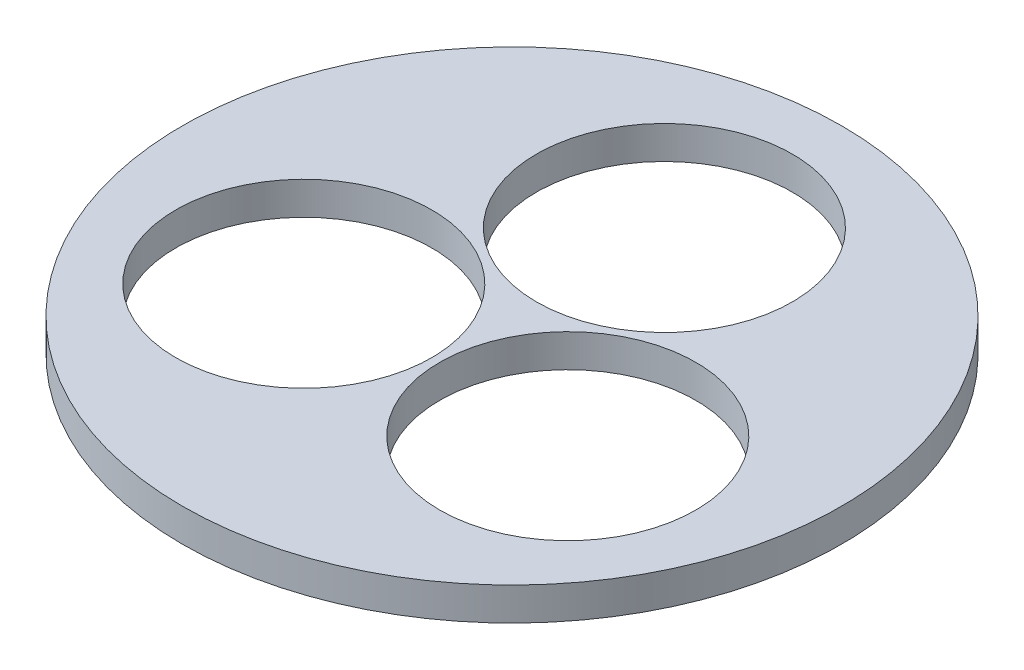
ISO-10303-21;
HEADER;
FILE_DESCRIPTION(('STEP AP214'),'2;1');
FILE_NAME('part.step','',(''),(''),'','','');
FILE_SCHEMA(('AUTOMOTIVE_DESIGN { 1 0 10303 214 1 1 1 1 }'));
ENDSEC;
DATA;
#1=APPLICATION_CONTEXT('core data for automotive mechanical design processes');
#2=APPLICATION_PROTOCOL_DEFINITION('international standard','automotive_design',2000,#1);
#3=PRODUCT_CONTEXT('',#1,'mechanical');
#4=PRODUCT('Part','Part','',(#3));
#5=PRODUCT_RELATED_PRODUCT_CATEGORY('part','',(#4));
#6=PRODUCT_DEFINITION_FORMATION('','',#4);
#7=PRODUCT_DEFINITION_CONTEXT('part definition',#1,'design');
#8=PRODUCT_DEFINITION('design','',#6,#7);
#9=PRODUCT_DEFINITION_SHAPE('','',#8);
#10=(LENGTH_UNIT() NAMED_UNIT(*) SI_UNIT(.MILLI.,.METRE.));
#11=(NAMED_UNIT(*) PLANE_ANGLE_UNIT() SI_UNIT($,.RADIAN.));
#12=(NAMED_UNIT(*) SI_UNIT($,.STERADIAN.) SOLID_ANGLE_UNIT());
#13=UNCERTAINTY_MEASURE_WITH_UNIT(LENGTH_MEASURE(1.E-05),#10,'distance_accuracy_value','');
#14=(GEOMETRIC_REPRESENTATION_CONTEXT(3) GLOBAL_UNCERTAINTY_ASSIGNED_CONTEXT((#13)) GLOBAL_UNIT_ASSIGNED_CONTEXT((#10,
#11,#12)) REPRESENTATION_CONTEXT('',''));
#15=CARTESIAN_POINT('',(0.,0.,0.));
#16=DIRECTION('',(0.,0.,1.));
#17=DIRECTION('',(1.,0.,0.));
#18=AXIS2_PLACEMENT_3D('',#15,#16,#17);
#19=CARTESIAN_POINT('',(0.,10.16,0.));
#20=DIRECTION('',(0.,-1.,0.));
#21=DIRECTION('',(0.,0.,-1.));
#22=AXIS2_PLACEMENT_3D('',#19,#20,#21);
#23=CYLINDRICAL_SURFACE('',#22,101.6);
#24=CARTESIAN_POINT('',(0.,10.16,0.));
#25=DIRECTION('',(0.,1.,0.));
#26=DIRECTION('',(0.,0.,1.));
#27=AXIS2_PLACEMENT_3D('',#24,#25,#26);
#28=CIRCLE('',#27,101.6);
#29=CARTESIAN_POINT('',(0.,10.16,101.6));
#30=VERTEX_POINT('',#29);
#31=EDGE_CURVE('E10',#30,#30,#28,.T.);
#32=ORIENTED_EDGE('',*,*,#31,.F.);
#33=EDGE_LOOP('',(#32));
#34=FACE_BOUND('',#33,.T.);
#35=CARTESIAN_POINT('',(0.,0.,0.));
#36=DIRECTION('',(0.,1.,0.));
#37=DIRECTION('',(0.,0.,1.));
#38=AXIS2_PLACEMENT_3D('',#35,#36,#37);
#39=CIRCLE('',#38,101.6);
#40=CARTESIAN_POINT('',(0.,0.,101.6));
#41=VERTEX_POINT('',#40);
#42=EDGE_CURVE('E38',#41,#41,#39,.T.);
#43=ORIENTED_EDGE('',*,*,#42,.T.);
#44=EDGE_LOOP('',(#43));
#45=FACE_BOUND('',#44,.T.);
#46=ADVANCED_FACE('F35',(#34,#45),#23,.T.);
#47=CARTESIAN_POINT('',(0.,10.16,0.));
#48=DIRECTION('',(0.,1.,0.));
#49=DIRECTION('',(0.,0.,1.));
#50=AXIS2_PLACEMENT_3D('',#47,#48,#49);
#51=PLANE('',#50);
#52=CARTESIAN_POINT('',(-40.694533723825,10.16,23.4949999999961));
#53=DIRECTION('',(0.,1.,0.));
#54=DIRECTION('',(0.,0.,1.));
#55=AXIS2_PLACEMENT_3D('',#52,#53,#54);
#56=CIRCLE('',#55,39.4716);
#57=CARTESIAN_POINT('',(-40.694533723825,10.16,62.9665999999961));
#58=VERTEX_POINT('',#57);
#59=EDGE_CURVE('E56',#58,#58,#56,.T.);
#60=ORIENTED_EDGE('',*,*,#59,.F.);
#61=EDGE_LOOP('',(#60));
#62=FACE_BOUND('',#61,.T.);
#63=CARTESIAN_POINT('',(40.6945337238365,10.16,23.4950000000039));
#64=DIRECTION('',(0.,1.,0.));
#65=DIRECTION('',(0.,0.,1.));
#66=AXIS2_PLACEMENT_3D('',#63,#64,#65);
#67=CIRCLE('',#66,39.4715999999999);
#68=CARTESIAN_POINT('',(40.6945337238365,10.16,62.9666000000038));
#69=VERTEX_POINT('',#68);
#70=EDGE_CURVE('E50',#69,#69,#67,.T.);
#71=ORIENTED_EDGE('',*,*,#70,.F.);
#72=EDGE_LOOP('',(#71));
#73=FACE_BOUND('',#72,.T.);
#74=CARTESIAN_POINT('',(1.25308594384312E-11,10.16,-46.99));
#75=DIRECTION('',(0.,1.,0.));
#76=DIRECTION('',(0.,0.,1.));
#77=AXIS2_PLACEMENT_3D('',#74,#75,#76);
#78=CIRCLE('',#77,39.4716);
#79=CARTESIAN_POINT('',(1.25308594384312E-11,10.16,-7.51839999999997));
#80=VERTEX_POINT('',#79);
#81=EDGE_CURVE('E47',#80,#80,#78,.T.);
#82=ORIENTED_EDGE('',*,*,#81,.F.);
#83=EDGE_LOOP('',(#82));
#84=FACE_BOUND('',#83,.T.);
#85=ORIENTED_EDGE('',*,*,#31,.T.);
#86=EDGE_LOOP('',(#85));
#87=FACE_BOUND('',#86,.T.);
#88=ADVANCED_FACE('F67',(#62,#73,#84,#87),#51,.T.);
#89=CARTESIAN_POINT('',(0.,0.,0.));
#90=DIRECTION('',(0.,1.,0.));
#91=DIRECTION('',(0.,0.,1.));
#92=AXIS2_PLACEMENT_3D('',#89,#90,#91);
#93=PLANE('',#92);
#94=CARTESIAN_POINT('',(-40.694533723825,0.,23.4949999999961));
#95=DIRECTION('',(0.,1.,0.));
#96=DIRECTION('',(0.,0.,1.));
#97=AXIS2_PLACEMENT_3D('',#94,#95,#96);
#98=CIRCLE('',#97,39.4716);
#99=CARTESIAN_POINT('',(-40.694533723825,0.,62.9665999999961));
#100=VERTEX_POINT('',#99);
#101=EDGE_CURVE('E53',#100,#100,#98,.T.);
#102=ORIENTED_EDGE('',*,*,#101,.T.);
#103=EDGE_LOOP('',(#102));
#104=FACE_BOUND('',#103,.T.);
#105=CARTESIAN_POINT('',(40.6945337238365,0.,23.4950000000039));
#106=DIRECTION('',(0.,1.,0.));
#107=DIRECTION('',(0.,0.,1.));
#108=AXIS2_PLACEMENT_3D('',#105,#106,#107);
#109=CIRCLE('',#108,39.4715999999999);
#110=CARTESIAN_POINT('',(40.6945337238365,0.,62.9666000000038));
#111=VERTEX_POINT('',#110);
#112=EDGE_CURVE('E59',#111,#111,#109,.T.);
#113=ORIENTED_EDGE('',*,*,#112,.T.);
#114=EDGE_LOOP('',(#113));
#115=FACE_BOUND('',#114,.T.);
#116=CARTESIAN_POINT('',(1.25308594384312E-11,0.,-46.99));
#117=DIRECTION('',(0.,1.,0.));
#118=DIRECTION('',(0.,0.,1.));
#119=AXIS2_PLACEMENT_3D('',#116,#117,#118);
#120=CIRCLE('',#119,39.4716);
#121=CARTESIAN_POINT('',(1.25308594384312E-11,0.,-7.51839999999997));
#122=VERTEX_POINT('',#121);
#123=EDGE_CURVE('E45',#122,#122,#120,.T.);
#124=ORIENTED_EDGE('',*,*,#123,.T.);
#125=EDGE_LOOP('',(#124));
#126=FACE_BOUND('',#125,.T.);
#127=ORIENTED_EDGE('',*,*,#42,.F.);
#128=EDGE_LOOP('',(#127));
#129=FACE_BOUND('',#128,.T.);
#130=ADVANCED_FACE('F70',(#104,#115,#126,#129),#93,.F.);
#131=CARTESIAN_POINT('',(1.25308594384312E-11,0.,-46.99));
#132=DIRECTION('',(0.,1.,0.));
#133=DIRECTION('',(0.,0.,1.));
#134=AXIS2_PLACEMENT_3D('',#131,#132,#133);
#135=CYLINDRICAL_SURFACE('',#134,39.4716);
#136=ORIENTED_EDGE('',*,*,#123,.F.);
#137=EDGE_LOOP('',(#136));
#138=FACE_BOUND('',#137,.T.);
#139=ORIENTED_EDGE('',*,*,#81,.T.);
#140=EDGE_LOOP('',(#139));
#141=FACE_BOUND('',#140,.T.);
#142=ADVANCED_FACE('F75',(#138,#141),#135,.F.);
#143=CARTESIAN_POINT('',(40.6945337238365,0.,23.4950000000039));
#144=DIRECTION('',(0.,1.,0.));
#145=DIRECTION('',(0.,0.,1.));
#146=AXIS2_PLACEMENT_3D('',#143,#144,#145);
#147=CYLINDRICAL_SURFACE('',#146,39.4715999999999);
#148=ORIENTED_EDGE('',*,*,#112,.F.);
#149=EDGE_LOOP('',(#148));
#150=FACE_BOUND('',#149,.T.);
#151=ORIENTED_EDGE('',*,*,#70,.T.);
#152=EDGE_LOOP('',(#151));
#153=FACE_BOUND('',#152,.T.);
#154=ADVANCED_FACE('F65',(#150,#153),#147,.F.);
#155=CARTESIAN_POINT('',(-40.694533723825,0.,23.4949999999961));
#156=DIRECTION('',(0.,1.,0.));
#157=DIRECTION('',(0.,0.,1.));
#158=AXIS2_PLACEMENT_3D('',#155,#156,#157);
#159=CYLINDRICAL_SURFACE('',#158,39.4716);
#160=ORIENTED_EDGE('',*,*,#101,.F.);
#161=EDGE_LOOP('',(#160));
#162=FACE_BOUND('',#161,.T.);
#163=ORIENTED_EDGE('',*,*,#59,.T.);
#164=EDGE_LOOP('',(#163));
#165=FACE_BOUND('',#164,.T.);
#166=ADVANCED_FACE('F83',(#162,#165),#159,.F.);
#167=CLOSED_SHELL('',(#46,#88,#130,#142,#154,#166));
#168=MANIFOLD_SOLID_BREP('B2',#167);
#169=ADVANCED_BREP_SHAPE_REPRESENTATION('',(#18,#168),#14);
#170=SHAPE_DEFINITION_REPRESENTATION(#9,#169);
ENDSEC;
END-ISO-10303-21;
